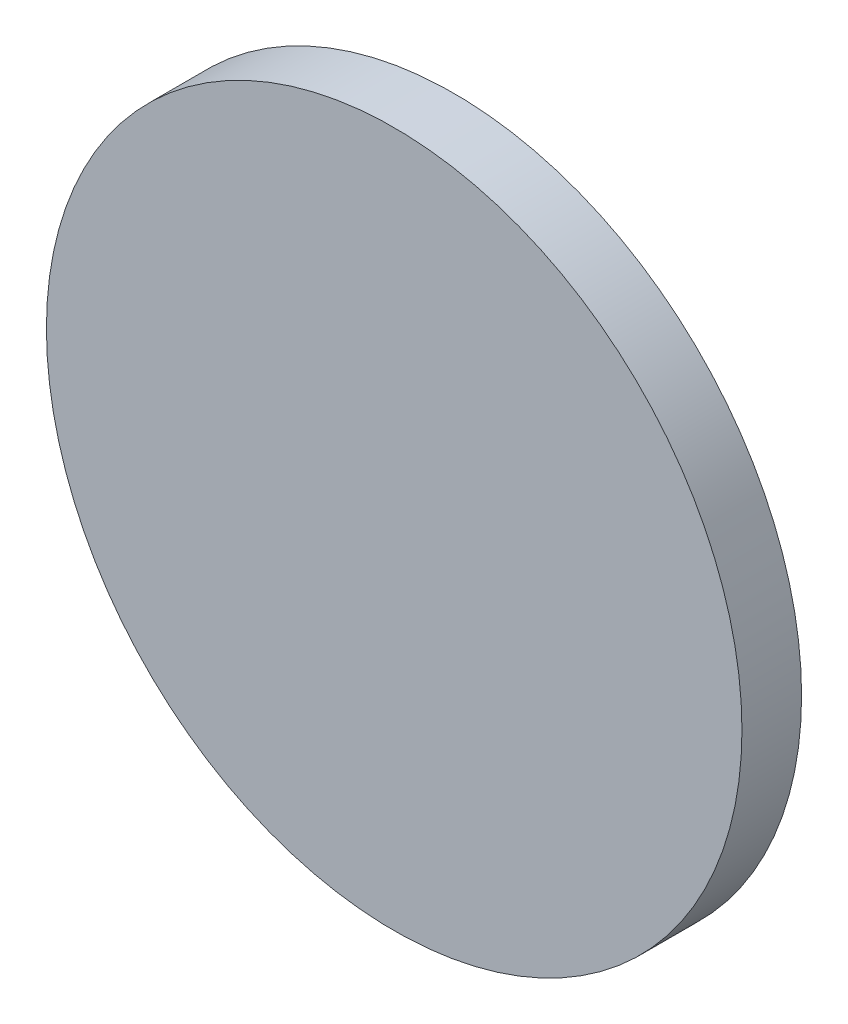
ISO-10303-21;
HEADER;
FILE_DESCRIPTION(('STEP AP214'),'2;1');
FILE_NAME('part.step','',(''),(''),'','','');
FILE_SCHEMA(('AUTOMOTIVE_DESIGN { 1 0 10303 214 1 1 1 1 }'));
ENDSEC;
DATA;
#1=APPLICATION_CONTEXT('core data for automotive mechanical design processes');
#2=APPLICATION_PROTOCOL_DEFINITION('international standard','automotive_design',2000,#1);
#3=PRODUCT_CONTEXT('',#1,'mechanical');
#4=PRODUCT('Part','Part','',(#3));
#5=PRODUCT_RELATED_PRODUCT_CATEGORY('part','',(#4));
#6=PRODUCT_DEFINITION_FORMATION('','',#4);
#7=PRODUCT_DEFINITION_CONTEXT('part definition',#1,'design');
#8=PRODUCT_DEFINITION('design','',#6,#7);
#9=PRODUCT_DEFINITION_SHAPE('','',#8);
#10=(LENGTH_UNIT() NAMED_UNIT(*) SI_UNIT(.MILLI.,.METRE.));
#11=(NAMED_UNIT(*) PLANE_ANGLE_UNIT() SI_UNIT($,.RADIAN.));
#12=(NAMED_UNIT(*) SI_UNIT($,.STERADIAN.) SOLID_ANGLE_UNIT());
#13=UNCERTAINTY_MEASURE_WITH_UNIT(LENGTH_MEASURE(1.E-05),#10,'distance_accuracy_value','');
#14=(GEOMETRIC_REPRESENTATION_CONTEXT(3) GLOBAL_UNCERTAINTY_ASSIGNED_CONTEXT((#13)) GLOBAL_UNIT_ASSIGNED_CONTEXT((#10,
#11,#12)) REPRESENTATION_CONTEXT('',''));
#15=CARTESIAN_POINT('',(0.,0.,0.));
#16=DIRECTION('',(0.,0.,1.));
#17=DIRECTION('',(1.,0.,0.));
#18=AXIS2_PLACEMENT_3D('',#15,#16,#17);
#19=CARTESIAN_POINT('',(11.18,1.973000014875,0.03429));
#20=DIRECTION('',(0.,0.,1.));
#21=DIRECTION('',(1.,0.,0.));
#22=AXIS2_PLACEMENT_3D('',#19,#20,#21);
#23=PLANE('',#22);
#24=CARTESIAN_POINT('',(11.18,1.973000014875,0.03429));
#25=DIRECTION('',(0.,0.,1.));
#26=DIRECTION('',(1.,0.,0.));
#27=AXIS2_PLACEMENT_3D('',#24,#25,#26);
#28=CIRCLE('',#27,0.200024667);
#29=CARTESIAN_POINT('',(11.380024667,1.973000014875,0.03429));
#30=VERTEX_POINT('',#29);
#31=EDGE_CURVE('E18',#30,#30,#28,.F.);
#32=ORIENTED_EDGE('',*,*,#31,.F.);
#33=EDGE_LOOP('',(#32));
#34=FACE_BOUND('',#33,.T.);
#35=ADVANCED_FACE('F15',(#34),#23,.T.);
#36=CARTESIAN_POINT('',(11.18,1.973000014875,0.));
#37=DIRECTION('',(0.,0.,1.));
#38=DIRECTION('',(1.,0.,0.));
#39=AXIS2_PLACEMENT_3D('',#36,#37,#38);
#40=CYLINDRICAL_SURFACE('',#39,0.200024667);
#41=ORIENTED_EDGE('',*,*,#31,.T.);
#42=EDGE_LOOP('',(#41));
#43=FACE_BOUND('',#42,.T.);
#44=CARTESIAN_POINT('',(11.18,1.973000014875,0.));
#45=DIRECTION('',(0.,0.,1.));
#46=DIRECTION('',(1.,0.,0.));
#47=AXIS2_PLACEMENT_3D('',#44,#45,#46);
#48=CIRCLE('',#47,0.200024667);
#49=CARTESIAN_POINT('',(11.380024667,1.973000014875,0.));
#50=VERTEX_POINT('',#49);
#51=EDGE_CURVE('E10',#50,#50,#48,.F.);
#52=ORIENTED_EDGE('',*,*,#51,.F.);
#53=EDGE_LOOP('',(#52));
#54=FACE_BOUND('',#53,.T.);
#55=ADVANCED_FACE('F27',(#43,#54),#40,.T.);
#56=CARTESIAN_POINT('',(11.18,1.973000014875,0.));
#57=DIRECTION('',(0.,0.,-1.));
#58=DIRECTION('',(-1.,0.,0.));
#59=AXIS2_PLACEMENT_3D('',#56,#57,#58);
#60=PLANE('',#59);
#61=ORIENTED_EDGE('',*,*,#51,.T.);
#62=EDGE_LOOP('',(#61));
#63=FACE_BOUND('',#62,.T.);
#64=ADVANCED_FACE('F35',(#63),#60,.T.);
#65=CLOSED_SHELL('',(#35,#55,#64));
#66=MANIFOLD_SOLID_BREP('B1',#65);
#67=ADVANCED_BREP_SHAPE_REPRESENTATION('',(#18,#66),#14);
#68=SHAPE_DEFINITION_REPRESENTATION(#9,#67);
ENDSEC;
END-ISO-10303-21;
